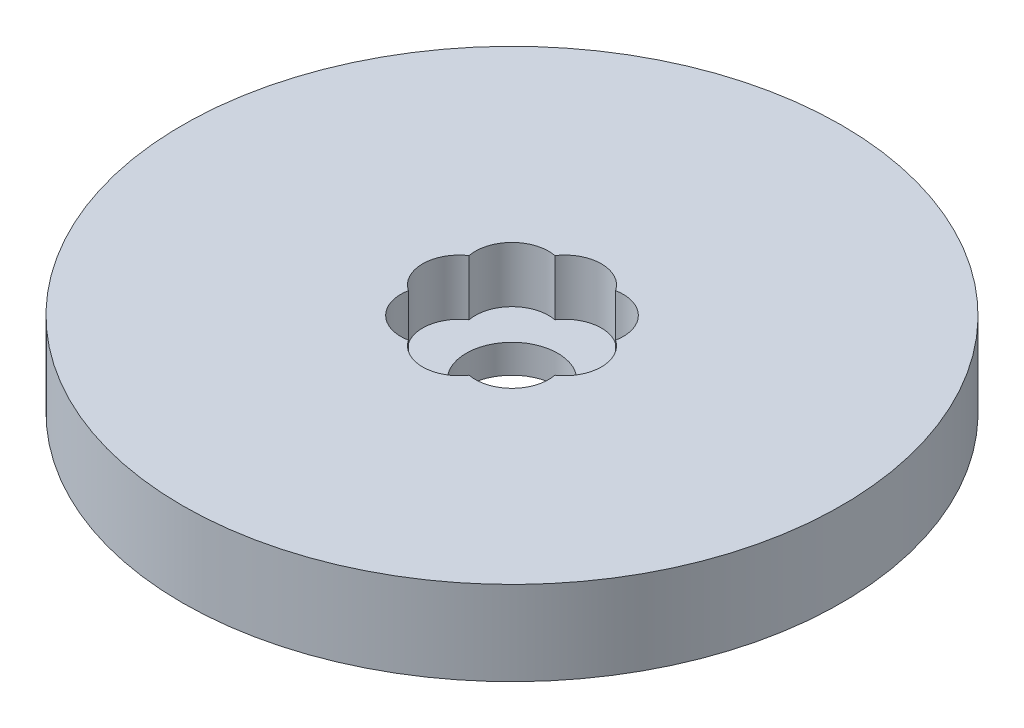
ISO-10303-21;
HEADER;
FILE_DESCRIPTION(('STEP AP214'),'2;1');
FILE_NAME('part.step','',(''),(''),'','','');
FILE_SCHEMA(('AUTOMOTIVE_DESIGN { 1 0 10303 214 1 1 1 1 }'));
ENDSEC;
DATA;
#1=APPLICATION_CONTEXT('core data for automotive mechanical design processes');
#2=APPLICATION_PROTOCOL_DEFINITION('international standard','automotive_design',2000,#1);
#3=PRODUCT_CONTEXT('',#1,'mechanical');
#4=PRODUCT('Part','Part','',(#3));
#5=PRODUCT_RELATED_PRODUCT_CATEGORY('part','',(#4));
#6=PRODUCT_DEFINITION_FORMATION('','',#4);
#7=PRODUCT_DEFINITION_CONTEXT('part definition',#1,'design');
#8=PRODUCT_DEFINITION('design','',#6,#7);
#9=PRODUCT_DEFINITION_SHAPE('','',#8);
#10=(LENGTH_UNIT() NAMED_UNIT(*) SI_UNIT(.MILLI.,.METRE.));
#11=(NAMED_UNIT(*) PLANE_ANGLE_UNIT() SI_UNIT($,.RADIAN.));
#12=(NAMED_UNIT(*) SI_UNIT($,.STERADIAN.) SOLID_ANGLE_UNIT());
#13=UNCERTAINTY_MEASURE_WITH_UNIT(LENGTH_MEASURE(1.E-05),#10,'distance_accuracy_value','');
#14=(GEOMETRIC_REPRESENTATION_CONTEXT(3) GLOBAL_UNCERTAINTY_ASSIGNED_CONTEXT((#13)) GLOBAL_UNIT_ASSIGNED_CONTEXT((#10,
#11,#12)) REPRESENTATION_CONTEXT('',''));
#15=CARTESIAN_POINT('',(0.,0.,0.));
#16=DIRECTION('',(0.,0.,1.));
#17=DIRECTION('',(1.,0.,0.));
#18=AXIS2_PLACEMENT_3D('',#15,#16,#17);
#19=CARTESIAN_POINT('',(0.,23.,0.));
#20=DIRECTION('',(0.,-1.,0.));
#21=DIRECTION('',(0.,0.,-1.));
#22=AXIS2_PLACEMENT_3D('',#19,#20,#21);
#23=CYLINDRICAL_SURFACE('',#22,12.5);
#24=CARTESIAN_POINT('',(0.,0.,0.));
#25=DIRECTION('',(0.,1.,0.));
#26=DIRECTION('',(0.,0.,1.));
#27=AXIS2_PLACEMENT_3D('',#24,#25,#26);
#28=CIRCLE('',#27,12.5);
#29=CARTESIAN_POINT('',(0.,0.,12.5));
#30=VERTEX_POINT('',#29);
#31=EDGE_CURVE('E166',#30,#30,#28,.T.);
#32=ORIENTED_EDGE('',*,*,#31,.F.);
#33=EDGE_LOOP('',(#32));
#34=FACE_BOUND('',#33,.T.);
#35=CARTESIAN_POINT('',(0.,7.80615975758499,0.));
#36=DIRECTION('',(0.,1.,0.));
#37=DIRECTION('',(0.,0.,1.));
#38=AXIS2_PLACEMENT_3D('',#35,#36,#37);
#39=CIRCLE('',#38,12.5);
#40=CARTESIAN_POINT('',(0.,7.80615975758499,12.5));
#41=VERTEX_POINT('',#40);
#42=EDGE_CURVE('E11',#41,#41,#39,.T.);
#43=ORIENTED_EDGE('',*,*,#42,.T.);
#44=EDGE_LOOP('',(#43));
#45=FACE_BOUND('',#44,.T.);
#46=ADVANCED_FACE('F39',(#34,#45),#23,.F.);
#47=CARTESIAN_POINT('',(0.,23.,0.));
#48=DIRECTION('',(0.,-1.,0.));
#49=DIRECTION('',(0.,0.,-1.));
#50=AXIS2_PLACEMENT_3D('',#47,#48,#49);
#51=CYLINDRICAL_SURFACE('',#50,90.);
#52=CARTESIAN_POINT('',(0.,23.,0.));
#53=DIRECTION('',(0.,1.,0.));
#54=DIRECTION('',(0.,0.,1.));
#55=AXIS2_PLACEMENT_3D('',#52,#53,#54);
#56=CIRCLE('',#55,90.);
#57=CARTESIAN_POINT('',(0.,23.,90.));
#58=VERTEX_POINT('',#57);
#59=EDGE_CURVE('E50',#58,#58,#56,.T.);
#60=ORIENTED_EDGE('',*,*,#59,.F.);
#61=EDGE_LOOP('',(#60));
#62=FACE_BOUND('',#61,.T.);
#63=CARTESIAN_POINT('',(0.,0.,0.));
#64=DIRECTION('',(0.,1.,0.));
#65=DIRECTION('',(0.,0.,1.));
#66=AXIS2_PLACEMENT_3D('',#63,#64,#65);
#67=CIRCLE('',#66,90.);
#68=CARTESIAN_POINT('',(0.,0.,90.));
#69=VERTEX_POINT('',#68);
#70=EDGE_CURVE('E173',#69,#69,#67,.T.);
#71=ORIENTED_EDGE('',*,*,#70,.T.);
#72=EDGE_LOOP('',(#71));
#73=FACE_BOUND('',#72,.T.);
#74=ADVANCED_FACE('F41',(#62,#73),#51,.T.);
#75=CARTESIAN_POINT('',(0.,23.,0.));
#76=DIRECTION('',(0.,1.,0.));
#77=DIRECTION('',(0.,0.,1.));
#78=AXIS2_PLACEMENT_3D('',#75,#76,#77);
#79=PLANE('',#78);
#80=CARTESIAN_POINT('',(-10.1877180072759,23.,10.187718007276));
#81=DIRECTION('',(0.,1.,0.));
#82=DIRECTION('',(0.707106781186549,0.,0.707106781186546));
#83=AXIS2_PLACEMENT_3D('',#80,#81,#82);
#84=CIRCLE('',#83,10.);
#85=CARTESIAN_POINT('',(-20.0053180964254,23.,8.28647407512733));
#86=VERTEX_POINT('',#85);
#87=CARTESIAN_POINT('',(-8.28647407512726,23.,20.0053180964254));
#88=VERTEX_POINT('',#87);
#89=EDGE_CURVE('E159',#86,#88,#84,.T.);
#90=ORIENTED_EDGE('',*,*,#89,.F.);
#91=CARTESIAN_POINT('',(-14.4076089755222,23.,0.));
#92=DIRECTION('',(0.,1.,0.));
#93=DIRECTION('',(0.,0.,1.));
#94=AXIS2_PLACEMENT_3D('',#91,#92,#93);
#95=CIRCLE('',#94,10.);
#96=CARTESIAN_POINT('',(-20.0053180964256,23.,-8.28647407512723));
#97=VERTEX_POINT('',#96);
#98=EDGE_CURVE('E167',#97,#86,#95,.T.);
#99=ORIENTED_EDGE('',*,*,#98,.F.);
#100=CARTESIAN_POINT('',(-10.1877180072761,23.,-10.1877180072758));
#101=DIRECTION('',(0.,1.,0.));
#102=DIRECTION('',(-0.707106781186539,0.,0.707106781186556));
#103=AXIS2_PLACEMENT_3D('',#100,#101,#102);
#104=CIRCLE('',#103,10.);
#105=CARTESIAN_POINT('',(-8.28647407512754,23.,-20.0053180964253));
#106=VERTEX_POINT('',#105);
#107=EDGE_CURVE('E53',#106,#97,#104,.T.);
#108=ORIENTED_EDGE('',*,*,#107,.F.);
#109=CARTESIAN_POINT('',(-1.50911693626154E-13,23.,-14.4076089755222));
#110=DIRECTION('',(0.,1.,0.));
#111=DIRECTION('',(-1.,0.,0.));
#112=AXIS2_PLACEMENT_3D('',#109,#110,#111);
#113=CIRCLE('',#112,10.);
#114=CARTESIAN_POINT('',(8.28647407512712,23.,-20.0053180964255));
#115=VERTEX_POINT('',#114);
#116=EDGE_CURVE('E117',#115,#106,#113,.T.);
#117=ORIENTED_EDGE('',*,*,#116,.F.);
#118=CARTESIAN_POINT('',(10.1877180072758,23.,-10.187718007276));
#119=DIRECTION('',(0.,1.,0.));
#120=DIRECTION('',(-0.707106781186554,0.,-0.707106781186541));
#121=AXIS2_PLACEMENT_3D('',#118,#119,#120);
#122=CIRCLE('',#121,10.);
#123=CARTESIAN_POINT('',(20.0053180964253,23.,-8.28647407512738));
#124=VERTEX_POINT('',#123);
#125=EDGE_CURVE('E120',#124,#115,#122,.T.);
#126=ORIENTED_EDGE('',*,*,#125,.F.);
#127=CARTESIAN_POINT('',(14.4076089755222,23.,0.));
#128=DIRECTION('',(0.,1.,0.));
#129=DIRECTION('',(0.,0.,-1.));
#130=AXIS2_PLACEMENT_3D('',#127,#128,#129);
#131=CIRCLE('',#130,10.);
#132=CARTESIAN_POINT('',(20.0053180964255,23.,8.28647407512728));
#133=VERTEX_POINT('',#132);
#134=EDGE_CURVE('E136',#133,#124,#131,.T.);
#135=ORIENTED_EDGE('',*,*,#134,.F.);
#136=CARTESIAN_POINT('',(10.187718007276,23.,10.1877180072759));
#137=DIRECTION('',(0.,1.,0.));
#138=DIRECTION('',(0.707106781186544,0.,-0.707106781186551));
#139=AXIS2_PLACEMENT_3D('',#136,#137,#138);
#140=CIRCLE('',#139,10.);
#141=CARTESIAN_POINT('',(8.2864740751274,23.,20.0053180964254));
#142=VERTEX_POINT('',#141);
#143=EDGE_CURVE('E138',#142,#133,#140,.T.);
#144=ORIENTED_EDGE('',*,*,#143,.F.);
#145=CARTESIAN_POINT('',(0.,23.,14.4076089755222));
#146=DIRECTION('',(0.,1.,0.));
#147=DIRECTION('',(1.,0.,0.));
#148=AXIS2_PLACEMENT_3D('',#145,#146,#147);
#149=CIRCLE('',#148,10.);
#150=EDGE_CURVE('E146',#88,#142,#149,.T.);
#151=ORIENTED_EDGE('',*,*,#150,.F.);
#152=EDGE_LOOP('',(#90,#99,#108,#117,#126,#135,#144,#151));
#153=FACE_BOUND('',#152,.T.);
#154=ORIENTED_EDGE('',*,*,#59,.T.);
#155=EDGE_LOOP('',(#154));
#156=FACE_BOUND('',#155,.T.);
#157=ADVANCED_FACE('F181',(#153,#156),#79,.T.);
#158=CARTESIAN_POINT('',(0.,0.,0.));
#159=DIRECTION('',(0.,1.,0.));
#160=DIRECTION('',(0.,0.,1.));
#161=AXIS2_PLACEMENT_3D('',#158,#159,#160);
#162=PLANE('',#161);
#163=ORIENTED_EDGE('',*,*,#31,.T.);
#164=EDGE_LOOP('',(#163));
#165=FACE_BOUND('',#164,.T.);
#166=ORIENTED_EDGE('',*,*,#70,.F.);
#167=EDGE_LOOP('',(#166));
#168=FACE_BOUND('',#167,.T.);
#169=ADVANCED_FACE('F179',(#165,#168),#162,.F.);
#170=CARTESIAN_POINT('',(-14.4076089755222,7.80615975758499,0.));
#171=DIRECTION('',(0.,1.,0.));
#172=DIRECTION('',(0.,0.,1.));
#173=AXIS2_PLACEMENT_3D('',#170,#171,#172);
#174=CYLINDRICAL_SURFACE('',#173,10.);
#175=ORIENTED_EDGE('',*,*,#98,.T.);
#176=DIRECTION('',(0.,1.,0.));
#177=VECTOR('',#176,1.);
#178=CARTESIAN_POINT('',(-20.0053180964254,15.4030798787925,8.28647407512733));
#179=LINE('',#178,#177);
#180=CARTESIAN_POINT('',(-20.0053180964254,7.80615975758499,8.28647407512733));
#181=VERTEX_POINT('',#180);
#182=EDGE_CURVE('E65',#86,#181,#179,.F.);
#183=ORIENTED_EDGE('',*,*,#182,.T.);
#184=CARTESIAN_POINT('',(-14.4076089755222,7.80615975758499,0.));
#185=DIRECTION('',(0.,1.,0.));
#186=DIRECTION('',(0.,0.,1.));
#187=AXIS2_PLACEMENT_3D('',#184,#185,#186);
#188=CIRCLE('',#187,10.);
#189=CARTESIAN_POINT('',(-20.0053180964256,7.80615975758499,-8.28647407512723));
#190=VERTEX_POINT('',#189);
#191=EDGE_CURVE('E170',#190,#181,#188,.T.);
#192=ORIENTED_EDGE('',*,*,#191,.F.);
#193=DIRECTION('',(0.,1.,0.));
#194=VECTOR('',#193,1.);
#195=CARTESIAN_POINT('',(-20.0053180964256,15.4030798787925,-8.28647407512723));
#196=LINE('',#195,#194);
#197=EDGE_CURVE('E124',#190,#97,#196,.T.);
#198=ORIENTED_EDGE('',*,*,#197,.T.);
#199=EDGE_LOOP('',(#175,#183,#192,#198));
#200=FACE_BOUND('',#199,.T.);
#201=ADVANCED_FACE('F185',(#200),#174,.F.);
#202=CARTESIAN_POINT('',(-14.4076089755222,7.80615975758499,0.));
#203=DIRECTION('',(0.,1.,0.));
#204=DIRECTION('',(0.,0.,1.));
#205=AXIS2_PLACEMENT_3D('',#202,#203,#204);
#206=PLANE('',#205);
#207=ORIENTED_EDGE('',*,*,#191,.T.);
#208=CARTESIAN_POINT('',(-10.1877180072759,7.80615975758499,10.187718007276));
#209=DIRECTION('',(0.,1.,0.));
#210=DIRECTION('',(0.707106781186549,0.,0.707106781186546));
#211=AXIS2_PLACEMENT_3D('',#208,#209,#210);
#212=CIRCLE('',#211,10.);
#213=CARTESIAN_POINT('',(-8.28647407512726,7.80615975758499,20.0053180964254));
#214=VERTEX_POINT('',#213);
#215=EDGE_CURVE('E161',#181,#214,#212,.T.);
#216=ORIENTED_EDGE('',*,*,#215,.T.);
#217=CARTESIAN_POINT('',(0.,7.80615975758499,14.4076089755222));
#218=DIRECTION('',(0.,1.,0.));
#219=DIRECTION('',(1.,0.,0.));
#220=AXIS2_PLACEMENT_3D('',#217,#218,#219);
#221=CIRCLE('',#220,10.);
#222=CARTESIAN_POINT('',(8.2864740751274,7.80615975758499,20.0053180964254));
#223=VERTEX_POINT('',#222);
#224=EDGE_CURVE('E149',#214,#223,#221,.T.);
#225=ORIENTED_EDGE('',*,*,#224,.T.);
#226=CARTESIAN_POINT('',(10.187718007276,7.80615975758499,10.1877180072759));
#227=DIRECTION('',(0.,1.,0.));
#228=DIRECTION('',(0.707106781186544,0.,-0.707106781186551));
#229=AXIS2_PLACEMENT_3D('',#226,#227,#228);
#230=CIRCLE('',#229,10.);
#231=CARTESIAN_POINT('',(20.0053180964255,7.80615975758499,8.28647407512728));
#232=VERTEX_POINT('',#231);
#233=EDGE_CURVE('E143',#223,#232,#230,.T.);
#234=ORIENTED_EDGE('',*,*,#233,.T.);
#235=CARTESIAN_POINT('',(14.4076089755222,7.80615975758499,0.));
#236=DIRECTION('',(0.,1.,0.));
#237=DIRECTION('',(0.,0.,-1.));
#238=AXIS2_PLACEMENT_3D('',#235,#236,#237);
#239=CIRCLE('',#238,10.);
#240=CARTESIAN_POINT('',(20.0053180964253,7.80615975758499,-8.28647407512738));
#241=VERTEX_POINT('',#240);
#242=EDGE_CURVE('E140',#232,#241,#239,.T.);
#243=ORIENTED_EDGE('',*,*,#242,.T.);
#244=CARTESIAN_POINT('',(10.1877180072758,7.80615975758499,-10.187718007276));
#245=DIRECTION('',(0.,1.,0.));
#246=DIRECTION('',(-0.707106781186554,0.,-0.707106781186541));
#247=AXIS2_PLACEMENT_3D('',#244,#245,#246);
#248=CIRCLE('',#247,10.);
#249=CARTESIAN_POINT('',(8.28647407512712,7.80615975758499,-20.0053180964255));
#250=VERTEX_POINT('',#249);
#251=EDGE_CURVE('E111',#241,#250,#248,.T.);
#252=ORIENTED_EDGE('',*,*,#251,.T.);
#253=CARTESIAN_POINT('',(-1.50911693626154E-13,7.80615975758499,-14.4076089755222));
#254=DIRECTION('',(0.,1.,0.));
#255=DIRECTION('',(-1.,0.,0.));
#256=AXIS2_PLACEMENT_3D('',#253,#254,#255);
#257=CIRCLE('',#256,10.);
#258=CARTESIAN_POINT('',(-8.28647407512754,7.80615975758499,-20.0053180964253));
#259=VERTEX_POINT('',#258);
#260=EDGE_CURVE('E104',#250,#259,#257,.T.);
#261=ORIENTED_EDGE('',*,*,#260,.T.);
#262=CARTESIAN_POINT('',(-10.1877180072761,7.80615975758499,-10.1877180072758));
#263=DIRECTION('',(0.,1.,0.));
#264=DIRECTION('',(-0.707106781186539,0.,0.707106781186556));
#265=AXIS2_PLACEMENT_3D('',#262,#263,#264);
#266=CIRCLE('',#265,10.);
#267=EDGE_CURVE('E112',#259,#190,#266,.T.);
#268=ORIENTED_EDGE('',*,*,#267,.T.);
#269=EDGE_LOOP('',(#207,#216,#225,#234,#243,#252,#261,#268));
#270=FACE_BOUND('',#269,.T.);
#271=ORIENTED_EDGE('',*,*,#42,.F.);
#272=EDGE_LOOP('',(#271));
#273=FACE_BOUND('',#272,.T.);
#274=ADVANCED_FACE('F107',(#270,#273),#206,.T.);
#275=CARTESIAN_POINT('',(-10.1877180072759,7.80615975758499,10.187718007276));
#276=DIRECTION('',(0.,1.,0.));
#277=DIRECTION('',(0.,0.,1.));
#278=AXIS2_PLACEMENT_3D('',#275,#276,#277);
#279=CYLINDRICAL_SURFACE('',#278,10.);
#280=ORIENTED_EDGE('',*,*,#89,.T.);
#281=DIRECTION('',(0.,1.,0.));
#282=VECTOR('',#281,1.);
#283=CARTESIAN_POINT('',(-8.28647407512726,15.4030798787925,20.0053180964254));
#284=LINE('',#283,#282);
#285=EDGE_CURVE('E160',#88,#214,#284,.F.);
#286=ORIENTED_EDGE('',*,*,#285,.T.);
#287=ORIENTED_EDGE('',*,*,#215,.F.);
#288=ORIENTED_EDGE('',*,*,#182,.F.);
#289=EDGE_LOOP('',(#280,#286,#287,#288));
#290=FACE_BOUND('',#289,.T.);
#291=ADVANCED_FACE('F202',(#290),#279,.F.);
#292=CARTESIAN_POINT('',(-10.1877180072761,7.80615975758499,-10.1877180072758));
#293=DIRECTION('',(0.,1.,0.));
#294=DIRECTION('',(0.,0.,1.));
#295=AXIS2_PLACEMENT_3D('',#292,#293,#294);
#296=CYLINDRICAL_SURFACE('',#295,10.);
#297=ORIENTED_EDGE('',*,*,#267,.F.);
#298=DIRECTION('',(0.,1.,0.));
#299=VECTOR('',#298,1.);
#300=CARTESIAN_POINT('',(-8.28647407512754,15.4030798787925,-20.0053180964253));
#301=LINE('',#300,#299);
#302=EDGE_CURVE('E119',#106,#259,#301,.F.);
#303=ORIENTED_EDGE('',*,*,#302,.F.);
#304=ORIENTED_EDGE('',*,*,#107,.T.);
#305=ORIENTED_EDGE('',*,*,#197,.F.);
#306=EDGE_LOOP('',(#297,#303,#304,#305));
#307=FACE_BOUND('',#306,.T.);
#308=ADVANCED_FACE('F123',(#307),#296,.F.);
#309=CARTESIAN_POINT('',(0.,7.80615975758499,14.4076089755222));
#310=DIRECTION('',(0.,1.,0.));
#311=DIRECTION('',(0.,0.,1.));
#312=AXIS2_PLACEMENT_3D('',#309,#310,#311);
#313=CYLINDRICAL_SURFACE('',#312,10.);
#314=ORIENTED_EDGE('',*,*,#150,.T.);
#315=DIRECTION('',(0.,1.,0.));
#316=VECTOR('',#315,1.);
#317=CARTESIAN_POINT('',(8.2864740751274,15.4030798787925,20.0053180964254));
#318=LINE('',#317,#316);
#319=EDGE_CURVE('E141',#142,#223,#318,.F.);
#320=ORIENTED_EDGE('',*,*,#319,.T.);
#321=ORIENTED_EDGE('',*,*,#224,.F.);
#322=ORIENTED_EDGE('',*,*,#285,.F.);
#323=EDGE_LOOP('',(#314,#320,#321,#322));
#324=FACE_BOUND('',#323,.T.);
#325=ADVANCED_FACE('F208',(#324),#313,.F.);
#326=CARTESIAN_POINT('',(10.187718007276,7.80615975758499,10.1877180072759));
#327=DIRECTION('',(0.,1.,0.));
#328=DIRECTION('',(0.,0.,1.));
#329=AXIS2_PLACEMENT_3D('',#326,#327,#328);
#330=CYLINDRICAL_SURFACE('',#329,10.);
#331=DIRECTION('',(0.,1.,0.));
#332=VECTOR('',#331,1.);
#333=CARTESIAN_POINT('',(20.0053180964255,15.4030798787925,8.28647407512728));
#334=LINE('',#333,#332);
#335=EDGE_CURVE('E151',#133,#232,#334,.F.);
#336=ORIENTED_EDGE('',*,*,#335,.T.);
#337=ORIENTED_EDGE('',*,*,#233,.F.);
#338=ORIENTED_EDGE('',*,*,#319,.F.);
#339=ORIENTED_EDGE('',*,*,#143,.T.);
#340=EDGE_LOOP('',(#336,#337,#338,#339));
#341=FACE_BOUND('',#340,.T.);
#342=ADVANCED_FACE('F211',(#341),#330,.F.);
#343=CARTESIAN_POINT('',(14.4076089755222,7.80615975758499,0.));
#344=DIRECTION('',(0.,1.,0.));
#345=DIRECTION('',(0.,0.,1.));
#346=AXIS2_PLACEMENT_3D('',#343,#344,#345);
#347=CYLINDRICAL_SURFACE('',#346,10.);
#348=ORIENTED_EDGE('',*,*,#134,.T.);
#349=DIRECTION('',(0.,1.,0.));
#350=VECTOR('',#349,1.);
#351=CARTESIAN_POINT('',(20.0053180964253,15.4030798787925,-8.28647407512738));
#352=LINE('',#351,#350);
#353=EDGE_CURVE('E131',#124,#241,#352,.F.);
#354=ORIENTED_EDGE('',*,*,#353,.T.);
#355=ORIENTED_EDGE('',*,*,#242,.F.);
#356=ORIENTED_EDGE('',*,*,#335,.F.);
#357=EDGE_LOOP('',(#348,#354,#355,#356));
#358=FACE_BOUND('',#357,.T.);
#359=ADVANCED_FACE('F214',(#358),#347,.F.);
#360=CARTESIAN_POINT('',(10.1877180072758,7.80615975758499,-10.187718007276));
#361=DIRECTION('',(0.,1.,0.));
#362=DIRECTION('',(0.,0.,1.));
#363=AXIS2_PLACEMENT_3D('',#360,#361,#362);
#364=CYLINDRICAL_SURFACE('',#363,10.);
#365=DIRECTION('',(0.,1.,0.));
#366=VECTOR('',#365,1.);
#367=CARTESIAN_POINT('',(8.28647407512712,15.4030798787925,-20.0053180964255));
#368=LINE('',#367,#366);
#369=EDGE_CURVE('E154',#115,#250,#368,.F.);
#370=ORIENTED_EDGE('',*,*,#369,.T.);
#371=ORIENTED_EDGE('',*,*,#251,.F.);
#372=ORIENTED_EDGE('',*,*,#353,.F.);
#373=ORIENTED_EDGE('',*,*,#125,.T.);
#374=EDGE_LOOP('',(#370,#371,#372,#373));
#375=FACE_BOUND('',#374,.T.);
#376=ADVANCED_FACE('F218',(#375),#364,.F.);
#377=CARTESIAN_POINT('',(-1.50911693626154E-13,7.80615975758499,-14.4076089755222));
#378=DIRECTION('',(0.,1.,0.));
#379=DIRECTION('',(0.,0.,1.));
#380=AXIS2_PLACEMENT_3D('',#377,#378,#379);
#381=CYLINDRICAL_SURFACE('',#380,10.);
#382=ORIENTED_EDGE('',*,*,#116,.T.);
#383=ORIENTED_EDGE('',*,*,#302,.T.);
#384=ORIENTED_EDGE('',*,*,#260,.F.);
#385=ORIENTED_EDGE('',*,*,#369,.F.);
#386=EDGE_LOOP('',(#382,#383,#384,#385));
#387=FACE_BOUND('',#386,.T.);
#388=ADVANCED_FACE('F121',(#387),#381,.F.);
#389=CLOSED_SHELL('',(#46,#74,#157,#169,#201,#274,#291,#308,#325,#342,#359,#376,#388));
#390=MANIFOLD_SOLID_BREP('B2',#389);
#391=ADVANCED_BREP_SHAPE_REPRESENTATION('',(#18,#390),#14);
#392=SHAPE_DEFINITION_REPRESENTATION(#9,#391);
ENDSEC;
END-ISO-10303-21;
